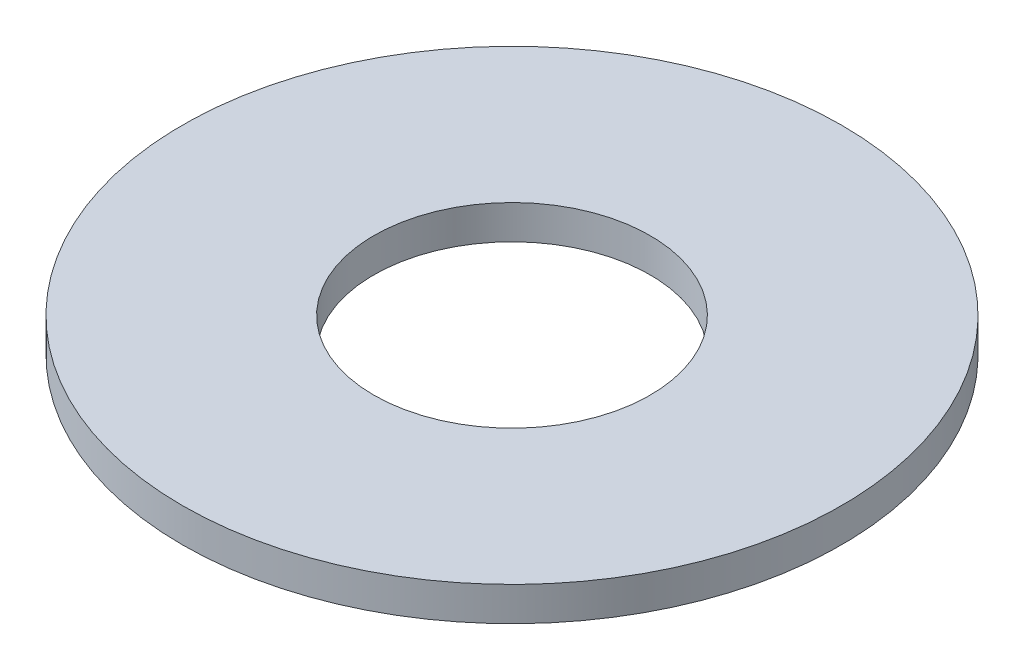
ISO-10303-21;
HEADER;
FILE_DESCRIPTION(('STEP AP214'),'2;1');
FILE_NAME('part.step','',(''),(''),'','','');
FILE_SCHEMA(('AUTOMOTIVE_DESIGN { 1 0 10303 214 1 1 1 1 }'));
ENDSEC;
DATA;
#1=APPLICATION_CONTEXT('core data for automotive mechanical design processes');
#2=APPLICATION_PROTOCOL_DEFINITION('international standard','automotive_design',2000,#1);
#3=PRODUCT_CONTEXT('',#1,'mechanical');
#4=PRODUCT('Part','Part','',(#3));
#5=PRODUCT_RELATED_PRODUCT_CATEGORY('part','',(#4));
#6=PRODUCT_DEFINITION_FORMATION('','',#4);
#7=PRODUCT_DEFINITION_CONTEXT('part definition',#1,'design');
#8=PRODUCT_DEFINITION('design','',#6,#7);
#9=PRODUCT_DEFINITION_SHAPE('','',#8);
#10=(LENGTH_UNIT() NAMED_UNIT(*) SI_UNIT(.MILLI.,.METRE.));
#11=(NAMED_UNIT(*) PLANE_ANGLE_UNIT() SI_UNIT($,.RADIAN.));
#12=(NAMED_UNIT(*) SI_UNIT($,.STERADIAN.) SOLID_ANGLE_UNIT());
#13=UNCERTAINTY_MEASURE_WITH_UNIT(LENGTH_MEASURE(1.E-05),#10,'distance_accuracy_value','');
#14=(GEOMETRIC_REPRESENTATION_CONTEXT(3) GLOBAL_UNCERTAINTY_ASSIGNED_CONTEXT((#13)) GLOBAL_UNIT_ASSIGNED_CONTEXT((#10,
#11,#12)) REPRESENTATION_CONTEXT('',''));
#15=CARTESIAN_POINT('',(0.,0.,0.));
#16=DIRECTION('',(0.,0.,1.));
#17=DIRECTION('',(1.,0.,0.));
#18=AXIS2_PLACEMENT_3D('',#15,#16,#17);
#19=CARTESIAN_POINT('',(0.,8.,0.));
#20=DIRECTION('',(0.,-1.,0.));
#21=DIRECTION('',(0.,0.,-1.));
#22=AXIS2_PLACEMENT_3D('',#19,#20,#21);
#23=CYLINDRICAL_SURFACE('',#22,77.5);
#24=CARTESIAN_POINT('',(0.,8.,0.));
#25=DIRECTION('',(0.,1.,0.));
#26=DIRECTION('',(0.,0.,1.));
#27=AXIS2_PLACEMENT_3D('',#24,#25,#26);
#28=CIRCLE('',#27,77.5);
#29=CARTESIAN_POINT('',(0.,8.,77.5));
#30=VERTEX_POINT('',#29);
#31=EDGE_CURVE('E10',#30,#30,#28,.T.);
#32=ORIENTED_EDGE('',*,*,#31,.F.);
#33=EDGE_LOOP('',(#32));
#34=FACE_BOUND('',#33,.T.);
#35=CARTESIAN_POINT('',(0.,0.,0.));
#36=DIRECTION('',(0.,1.,0.));
#37=DIRECTION('',(0.,0.,1.));
#38=AXIS2_PLACEMENT_3D('',#35,#36,#37);
#39=CIRCLE('',#38,77.5);
#40=CARTESIAN_POINT('',(0.,0.,77.5));
#41=VERTEX_POINT('',#40);
#42=EDGE_CURVE('E37',#41,#41,#39,.T.);
#43=ORIENTED_EDGE('',*,*,#42,.T.);
#44=EDGE_LOOP('',(#43));
#45=FACE_BOUND('',#44,.T.);
#46=ADVANCED_FACE('F40',(#34,#45),#23,.T.);
#47=CARTESIAN_POINT('',(0.,8.,0.));
#48=DIRECTION('',(0.,1.,0.));
#49=DIRECTION('',(0.,0.,1.));
#50=AXIS2_PLACEMENT_3D('',#47,#48,#49);
#51=PLANE('',#50);
#52=CARTESIAN_POINT('',(0.,8.,0.));
#53=DIRECTION('',(0.,1.,0.));
#54=DIRECTION('',(0.,0.,1.));
#55=AXIS2_PLACEMENT_3D('',#52,#53,#54);
#56=CIRCLE('',#55,32.5);
#57=CARTESIAN_POINT('',(0.,8.,32.5));
#58=VERTEX_POINT('',#57);
#59=EDGE_CURVE('E50',#58,#58,#56,.T.);
#60=ORIENTED_EDGE('',*,*,#59,.F.);
#61=EDGE_LOOP('',(#60));
#62=FACE_BOUND('',#61,.T.);
#63=ORIENTED_EDGE('',*,*,#31,.T.);
#64=EDGE_LOOP('',(#63));
#65=FACE_BOUND('',#64,.T.);
#66=ADVANCED_FACE('F59',(#62,#65),#51,.T.);
#67=CARTESIAN_POINT('',(0.,0.,0.));
#68=DIRECTION('',(0.,1.,0.));
#69=DIRECTION('',(0.,0.,1.));
#70=AXIS2_PLACEMENT_3D('',#67,#68,#69);
#71=PLANE('',#70);
#72=CARTESIAN_POINT('',(0.,0.,0.));
#73=DIRECTION('',(0.,1.,0.));
#74=DIRECTION('',(0.,0.,1.));
#75=AXIS2_PLACEMENT_3D('',#72,#73,#74);
#76=CIRCLE('',#75,32.5);
#77=CARTESIAN_POINT('',(0.,0.,32.5));
#78=VERTEX_POINT('',#77);
#79=EDGE_CURVE('E47',#78,#78,#76,.T.);
#80=ORIENTED_EDGE('',*,*,#79,.T.);
#81=EDGE_LOOP('',(#80));
#82=FACE_BOUND('',#81,.T.);
#83=ORIENTED_EDGE('',*,*,#42,.F.);
#84=EDGE_LOOP('',(#83));
#85=FACE_BOUND('',#84,.T.);
#86=ADVANCED_FACE('F58',(#82,#85),#71,.F.);
#87=CARTESIAN_POINT('',(0.,8.,0.));
#88=DIRECTION('',(0.,-1.,0.));
#89=DIRECTION('',(0.,0.,-1.));
#90=AXIS2_PLACEMENT_3D('',#87,#88,#89);
#91=CYLINDRICAL_SURFACE('',#90,32.5);
#92=ORIENTED_EDGE('',*,*,#59,.T.);
#93=EDGE_LOOP('',(#92));
#94=FACE_BOUND('',#93,.T.);
#95=ORIENTED_EDGE('',*,*,#79,.F.);
#96=EDGE_LOOP('',(#95));
#97=FACE_BOUND('',#96,.T.);
#98=ADVANCED_FACE('F54',(#94,#97),#91,.F.);
#99=CLOSED_SHELL('',(#46,#66,#86,#98));
#100=MANIFOLD_SOLID_BREP('B2',#99);
#101=ADVANCED_BREP_SHAPE_REPRESENTATION('',(#18,#100),#14);
#102=SHAPE_DEFINITION_REPRESENTATION(#9,#101);
ENDSEC;
END-ISO-10303-21;
